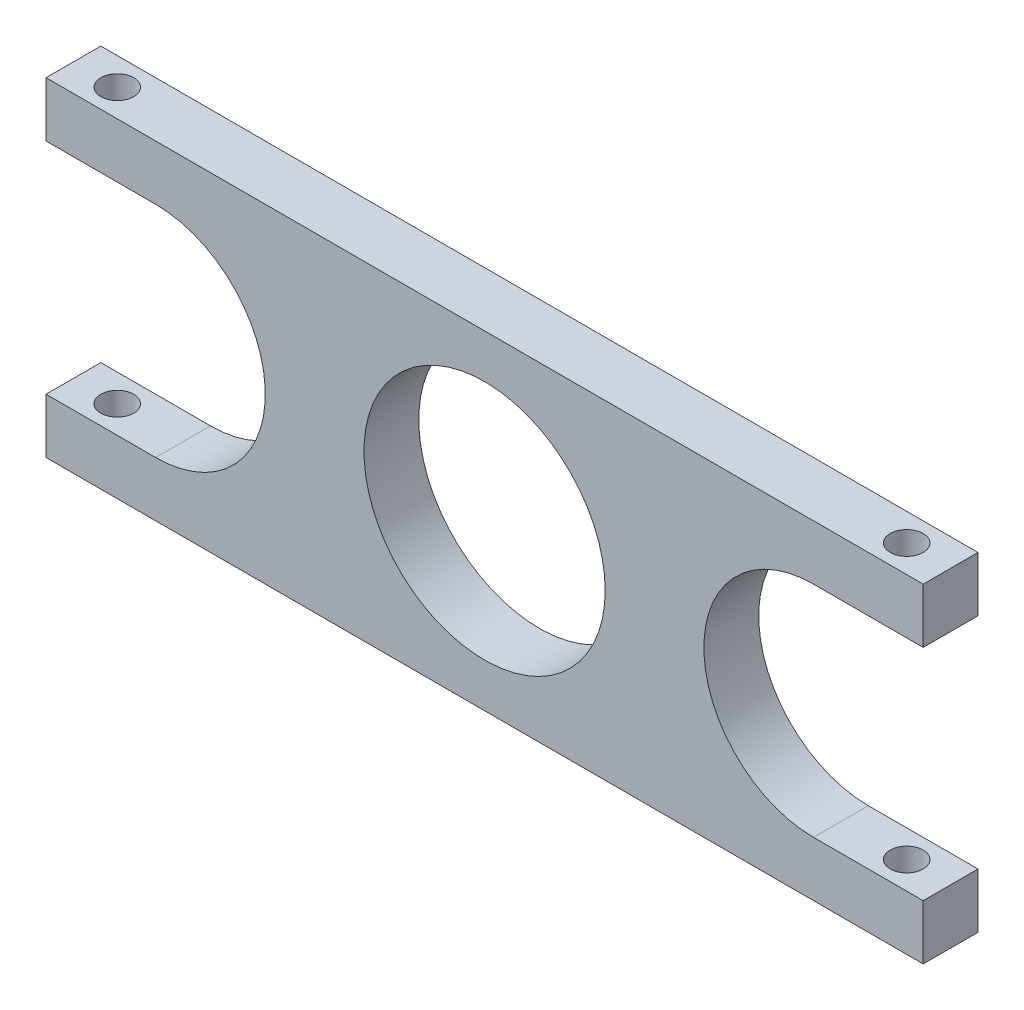
ISO-10303-21;
HEADER;
FILE_DESCRIPTION(('STEP AP214'),'2;1');
FILE_NAME('part.step','',(''),(''),'','','');
FILE_SCHEMA(('AUTOMOTIVE_DESIGN { 1 0 10303 214 1 1 1 1 }'));
ENDSEC;
DATA;
#1=APPLICATION_CONTEXT('core data for automotive mechanical design processes');
#2=APPLICATION_PROTOCOL_DEFINITION('international standard','automotive_design',2000,#1);
#3=PRODUCT_CONTEXT('',#1,'mechanical');
#4=PRODUCT('Part','Part','',(#3));
#5=PRODUCT_RELATED_PRODUCT_CATEGORY('part','',(#4));
#6=PRODUCT_DEFINITION_FORMATION('','',#4);
#7=PRODUCT_DEFINITION_CONTEXT('part definition',#1,'design');
#8=PRODUCT_DEFINITION('design','',#6,#7);
#9=PRODUCT_DEFINITION_SHAPE('','',#8);
#10=(LENGTH_UNIT() NAMED_UNIT(*) SI_UNIT(.MILLI.,.METRE.));
#11=(NAMED_UNIT(*) PLANE_ANGLE_UNIT() SI_UNIT($,.RADIAN.));
#12=(NAMED_UNIT(*) SI_UNIT($,.STERADIAN.) SOLID_ANGLE_UNIT());
#13=UNCERTAINTY_MEASURE_WITH_UNIT(LENGTH_MEASURE(1.E-05),#10,'distance_accuracy_value','');
#14=(GEOMETRIC_REPRESENTATION_CONTEXT(3) GLOBAL_UNCERTAINTY_ASSIGNED_CONTEXT((#13)) GLOBAL_UNIT_ASSIGNED_CONTEXT((#10,
#11,#12)) REPRESENTATION_CONTEXT('',''));
#15=CARTESIAN_POINT('',(0.,0.,0.));
#16=DIRECTION('',(0.,0.,1.));
#17=DIRECTION('',(1.,0.,0.));
#18=AXIS2_PLACEMENT_3D('',#15,#16,#17);
#19=CARTESIAN_POINT('',(70.,15.,5.));
#20=DIRECTION('',(0.,0.,1.));
#21=DIRECTION('',(1.,0.,0.));
#22=AXIS2_PLACEMENT_3D('',#19,#20,#21);
#23=PLANE('',#22);
#24=DIRECTION('',(0.,-1.,0.));
#25=VECTOR('',#24,1.);
#26=CARTESIAN_POINT('',(0.,5.,5.));
#27=LINE('',#26,#25);
#28=CARTESIAN_POINT('',(0.,5.,5.));
#29=VERTEX_POINT('',#28);
#30=CARTESIAN_POINT('',(0.,0.,5.));
#31=VERTEX_POINT('',#30);
#32=EDGE_CURVE('E190',#29,#31,#27,.T.);
#33=ORIENTED_EDGE('',*,*,#32,.T.);
#34=DIRECTION('',(1.,0.,0.));
#35=VECTOR('',#34,1.);
#36=CARTESIAN_POINT('',(0.,0.,5.));
#37=LINE('',#36,#35);
#38=CARTESIAN_POINT('',(80.,0.,5.));
#39=VERTEX_POINT('',#38);
#40=EDGE_CURVE('E118',#31,#39,#37,.T.);
#41=ORIENTED_EDGE('',*,*,#40,.T.);
#42=DIRECTION('',(0.,1.,0.));
#43=VECTOR('',#42,1.);
#44=CARTESIAN_POINT('',(80.,0.,5.));
#45=LINE('',#44,#43);
#46=CARTESIAN_POINT('',(80.,5.,5.));
#47=VERTEX_POINT('',#46);
#48=EDGE_CURVE('E218',#39,#47,#45,.T.);
#49=ORIENTED_EDGE('',*,*,#48,.T.);
#50=DIRECTION('',(-1.,0.,0.));
#51=VECTOR('',#50,1.);
#52=CARTESIAN_POINT('',(80.,5.,5.));
#53=LINE('',#52,#51);
#54=CARTESIAN_POINT('',(70.,5.,5.));
#55=VERTEX_POINT('',#54);
#56=EDGE_CURVE('E237',#47,#55,#53,.T.);
#57=ORIENTED_EDGE('',*,*,#56,.T.);
#58=CARTESIAN_POINT('',(70.,15.,5.));
#59=DIRECTION('',(0.,0.,-1.));
#60=DIRECTION('',(1.,0.,0.));
#61=AXIS2_PLACEMENT_3D('',#58,#59,#60);
#62=CIRCLE('',#61,10.);
#63=CARTESIAN_POINT('',(70.,25.,5.));
#64=VERTEX_POINT('',#63);
#65=EDGE_CURVE('E234',#55,#64,#62,.T.);
#66=ORIENTED_EDGE('',*,*,#65,.T.);
#67=DIRECTION('',(1.,0.,0.));
#68=VECTOR('',#67,1.);
#69=CARTESIAN_POINT('',(70.,25.,5.));
#70=LINE('',#69,#68);
#71=CARTESIAN_POINT('',(80.,25.,5.));
#72=VERTEX_POINT('',#71);
#73=EDGE_CURVE('E236',#64,#72,#70,.T.);
#74=ORIENTED_EDGE('',*,*,#73,.T.);
#75=DIRECTION('',(0.,1.,0.));
#76=VECTOR('',#75,1.);
#77=CARTESIAN_POINT('',(80.,25.,5.));
#78=LINE('',#77,#76);
#79=CARTESIAN_POINT('',(80.,30.,5.));
#80=VERTEX_POINT('',#79);
#81=EDGE_CURVE('E239',#72,#80,#78,.T.);
#82=ORIENTED_EDGE('',*,*,#81,.T.);
#83=DIRECTION('',(-1.,0.,0.));
#84=VECTOR('',#83,1.);
#85=CARTESIAN_POINT('',(80.,30.,5.));
#86=LINE('',#85,#84);
#87=CARTESIAN_POINT('',(0.,30.,5.));
#88=VERTEX_POINT('',#87);
#89=EDGE_CURVE('E245',#80,#88,#86,.T.);
#90=ORIENTED_EDGE('',*,*,#89,.T.);
#91=DIRECTION('',(0.,-1.,0.));
#92=VECTOR('',#91,1.);
#93=CARTESIAN_POINT('',(0.,30.,5.));
#94=LINE('',#93,#92);
#95=CARTESIAN_POINT('',(0.,25.,5.));
#96=VERTEX_POINT('',#95);
#97=EDGE_CURVE('E149',#88,#96,#94,.T.);
#98=ORIENTED_EDGE('',*,*,#97,.T.);
#99=DIRECTION('',(1.,0.,0.));
#100=VECTOR('',#99,1.);
#101=CARTESIAN_POINT('',(0.,25.,5.));
#102=LINE('',#101,#100);
#103=CARTESIAN_POINT('',(10.,25.,5.));
#104=VERTEX_POINT('',#103);
#105=EDGE_CURVE('E143',#96,#104,#102,.T.);
#106=ORIENTED_EDGE('',*,*,#105,.T.);
#107=CARTESIAN_POINT('',(10.,15.,5.));
#108=DIRECTION('',(0.,0.,-1.));
#109=DIRECTION('',(-1.,0.,0.));
#110=AXIS2_PLACEMENT_3D('',#107,#108,#109);
#111=CIRCLE('',#110,9.99999999999999);
#112=CARTESIAN_POINT('',(10.,5.,5.));
#113=VERTEX_POINT('',#112);
#114=EDGE_CURVE('E147',#104,#113,#111,.T.);
#115=ORIENTED_EDGE('',*,*,#114,.T.);
#116=DIRECTION('',(-1.,0.,0.));
#117=VECTOR('',#116,1.);
#118=CARTESIAN_POINT('',(10.,5.,5.));
#119=LINE('',#118,#117);
#120=EDGE_CURVE('E63',#113,#29,#119,.T.);
#121=ORIENTED_EDGE('',*,*,#120,.T.);
#122=EDGE_LOOP('',(#33,#41,#49,#57,#66,#74,#82,#90,#98,#106,#115,#121));
#123=FACE_BOUND('',#122,.T.);
#124=CARTESIAN_POINT('',(40.,15.,5.));
#125=DIRECTION('',(0.,0.,1.));
#126=DIRECTION('',(1.,0.,0.));
#127=AXIS2_PLACEMENT_3D('',#124,#125,#126);
#128=CIRCLE('',#127,11.);
#129=CARTESIAN_POINT('',(51.,15.,5.));
#130=VERTEX_POINT('',#129);
#131=EDGE_CURVE('E171',#130,#130,#128,.T.);
#132=ORIENTED_EDGE('',*,*,#131,.F.);
#133=EDGE_LOOP('',(#132));
#134=FACE_BOUND('',#133,.T.);
#135=ADVANCED_FACE('F45',(#123,#134),#23,.T.);
#136=CARTESIAN_POINT('',(70.,15.,0.));
#137=DIRECTION('',(0.,0.,1.));
#138=DIRECTION('',(1.,0.,0.));
#139=AXIS2_PLACEMENT_3D('',#136,#137,#138);
#140=PLANE('',#139);
#141=DIRECTION('',(0.,-1.,0.));
#142=VECTOR('',#141,1.);
#143=CARTESIAN_POINT('',(0.,5.,0.));
#144=LINE('',#143,#142);
#145=CARTESIAN_POINT('',(0.,5.,0.));
#146=VERTEX_POINT('',#145);
#147=CARTESIAN_POINT('',(0.,0.,0.));
#148=VERTEX_POINT('',#147);
#149=EDGE_CURVE('E167',#146,#148,#144,.T.);
#150=ORIENTED_EDGE('',*,*,#149,.F.);
#151=DIRECTION('',(-1.,0.,0.));
#152=VECTOR('',#151,1.);
#153=CARTESIAN_POINT('',(10.,5.,0.));
#154=LINE('',#153,#152);
#155=CARTESIAN_POINT('',(10.,5.,0.));
#156=VERTEX_POINT('',#155);
#157=EDGE_CURVE('E110',#156,#146,#154,.T.);
#158=ORIENTED_EDGE('',*,*,#157,.F.);
#159=CARTESIAN_POINT('',(10.,15.,0.));
#160=DIRECTION('',(0.,0.,-1.));
#161=DIRECTION('',(-1.,0.,0.));
#162=AXIS2_PLACEMENT_3D('',#159,#160,#161);
#163=CIRCLE('',#162,9.99999999999999);
#164=CARTESIAN_POINT('',(10.,25.,0.));
#165=VERTEX_POINT('',#164);
#166=EDGE_CURVE('E104',#165,#156,#163,.T.);
#167=ORIENTED_EDGE('',*,*,#166,.F.);
#168=DIRECTION('',(1.,0.,0.));
#169=VECTOR('',#168,1.);
#170=CARTESIAN_POINT('',(0.,25.,0.));
#171=LINE('',#170,#169);
#172=CARTESIAN_POINT('',(0.,25.,0.));
#173=VERTEX_POINT('',#172);
#174=EDGE_CURVE('E157',#173,#165,#171,.T.);
#175=ORIENTED_EDGE('',*,*,#174,.F.);
#176=DIRECTION('',(0.,-1.,0.));
#177=VECTOR('',#176,1.);
#178=CARTESIAN_POINT('',(0.,30.,0.));
#179=LINE('',#178,#177);
#180=CARTESIAN_POINT('',(0.,30.,0.));
#181=VERTEX_POINT('',#180);
#182=EDGE_CURVE('E185',#181,#173,#179,.T.);
#183=ORIENTED_EDGE('',*,*,#182,.F.);
#184=DIRECTION('',(-1.,0.,0.));
#185=VECTOR('',#184,1.);
#186=CARTESIAN_POINT('',(80.,30.,0.));
#187=LINE('',#186,#185);
#188=CARTESIAN_POINT('',(80.,30.,0.));
#189=VERTEX_POINT('',#188);
#190=EDGE_CURVE('E183',#189,#181,#187,.T.);
#191=ORIENTED_EDGE('',*,*,#190,.F.);
#192=DIRECTION('',(0.,1.,0.));
#193=VECTOR('',#192,1.);
#194=CARTESIAN_POINT('',(80.,25.,0.));
#195=LINE('',#194,#193);
#196=CARTESIAN_POINT('',(80.,25.,0.));
#197=VERTEX_POINT('',#196);
#198=EDGE_CURVE('E181',#197,#189,#195,.T.);
#199=ORIENTED_EDGE('',*,*,#198,.F.);
#200=DIRECTION('',(1.,0.,0.));
#201=VECTOR('',#200,1.);
#202=CARTESIAN_POINT('',(70.,25.,0.));
#203=LINE('',#202,#201);
#204=CARTESIAN_POINT('',(70.,25.,0.));
#205=VERTEX_POINT('',#204);
#206=EDGE_CURVE('E179',#205,#197,#203,.T.);
#207=ORIENTED_EDGE('',*,*,#206,.F.);
#208=CARTESIAN_POINT('',(70.,15.,0.));
#209=DIRECTION('',(0.,0.,-1.));
#210=DIRECTION('',(1.,0.,0.));
#211=AXIS2_PLACEMENT_3D('',#208,#209,#210);
#212=CIRCLE('',#211,10.);
#213=CARTESIAN_POINT('',(70.,5.,0.));
#214=VERTEX_POINT('',#213);
#215=EDGE_CURVE('E177',#214,#205,#212,.T.);
#216=ORIENTED_EDGE('',*,*,#215,.F.);
#217=DIRECTION('',(-1.,0.,0.));
#218=VECTOR('',#217,1.);
#219=CARTESIAN_POINT('',(80.,5.,0.));
#220=LINE('',#219,#218);
#221=CARTESIAN_POINT('',(80.,5.,0.));
#222=VERTEX_POINT('',#221);
#223=EDGE_CURVE('E175',#222,#214,#220,.T.);
#224=ORIENTED_EDGE('',*,*,#223,.F.);
#225=DIRECTION('',(0.,1.,0.));
#226=VECTOR('',#225,1.);
#227=CARTESIAN_POINT('',(80.,0.,0.));
#228=LINE('',#227,#226);
#229=CARTESIAN_POINT('',(80.,0.,0.));
#230=VERTEX_POINT('',#229);
#231=EDGE_CURVE('E173',#230,#222,#228,.T.);
#232=ORIENTED_EDGE('',*,*,#231,.F.);
#233=DIRECTION('',(1.,0.,0.));
#234=VECTOR('',#233,1.);
#235=CARTESIAN_POINT('',(0.,0.,0.));
#236=LINE('',#235,#234);
#237=EDGE_CURVE('E170',#148,#230,#236,.T.);
#238=ORIENTED_EDGE('',*,*,#237,.F.);
#239=EDGE_LOOP('',(#150,#158,#167,#175,#183,#191,#199,#207,#216,#224,#232,#238));
#240=FACE_BOUND('',#239,.T.);
#241=CARTESIAN_POINT('',(40.,15.,0.));
#242=DIRECTION('',(0.,0.,1.));
#243=DIRECTION('',(1.,0.,0.));
#244=AXIS2_PLACEMENT_3D('',#241,#242,#243);
#245=CIRCLE('',#244,11.);
#246=CARTESIAN_POINT('',(51.,15.,0.));
#247=VERTEX_POINT('',#246);
#248=EDGE_CURVE('E315',#247,#247,#245,.T.);
#249=ORIENTED_EDGE('',*,*,#248,.T.);
#250=EDGE_LOOP('',(#249));
#251=FACE_BOUND('',#250,.T.);
#252=ADVANCED_FACE('F222',(#240,#251),#140,.F.);
#253=CARTESIAN_POINT('',(0.,5.,5.));
#254=DIRECTION('',(1.,0.,0.));
#255=DIRECTION('',(0.,1.,0.));
#256=AXIS2_PLACEMENT_3D('',#253,#254,#255);
#257=PLANE('',#256);
#258=ORIENTED_EDGE('',*,*,#149,.T.);
#259=DIRECTION('',(0.,0.,-1.));
#260=VECTOR('',#259,1.);
#261=CARTESIAN_POINT('',(0.,0.,5.));
#262=LINE('',#261,#260);
#263=EDGE_CURVE('E13',#31,#148,#262,.T.);
#264=ORIENTED_EDGE('',*,*,#263,.F.);
#265=ORIENTED_EDGE('',*,*,#32,.F.);
#266=DIRECTION('',(0.,0.,-1.));
#267=VECTOR('',#266,1.);
#268=CARTESIAN_POINT('',(0.,5.,5.));
#269=LINE('',#268,#267);
#270=EDGE_CURVE('E163',#29,#146,#269,.T.);
#271=ORIENTED_EDGE('',*,*,#270,.T.);
#272=EDGE_LOOP('',(#258,#264,#265,#271));
#273=FACE_BOUND('',#272,.T.);
#274=ADVANCED_FACE('F47',(#273),#257,.F.);
#275=CARTESIAN_POINT('',(0.,0.,5.));
#276=DIRECTION('',(0.,1.,0.));
#277=DIRECTION('',(0.,0.,1.));
#278=AXIS2_PLACEMENT_3D('',#275,#276,#277);
#279=PLANE('',#278);
#280=CARTESIAN_POINT('',(4.,0.,2.5));
#281=DIRECTION('',(0.,1.,0.));
#282=DIRECTION('',(0.,0.,1.));
#283=AXIS2_PLACEMENT_3D('',#280,#281,#282);
#284=CIRCLE('',#283,1.49999999999999);
#285=CARTESIAN_POINT('',(4.,0.,3.99999999999999));
#286=VERTEX_POINT('',#285);
#287=EDGE_CURVE('E306',#286,#286,#284,.T.);
#288=ORIENTED_EDGE('',*,*,#287,.T.);
#289=EDGE_LOOP('',(#288));
#290=FACE_BOUND('',#289,.T.);
#291=CARTESIAN_POINT('',(76.,0.,2.5));
#292=DIRECTION('',(0.,1.,0.));
#293=DIRECTION('',(0.,0.,1.));
#294=AXIS2_PLACEMENT_3D('',#291,#292,#293);
#295=CIRCLE('',#294,1.49999999999999);
#296=CARTESIAN_POINT('',(76.,0.,3.99999999999999));
#297=VERTEX_POINT('',#296);
#298=EDGE_CURVE('E304',#297,#297,#295,.T.);
#299=ORIENTED_EDGE('',*,*,#298,.T.);
#300=EDGE_LOOP('',(#299));
#301=FACE_BOUND('',#300,.T.);
#302=ORIENTED_EDGE('',*,*,#237,.T.);
#303=DIRECTION('',(0.,0.,-1.));
#304=VECTOR('',#303,1.);
#305=CARTESIAN_POINT('',(80.,0.,5.));
#306=LINE('',#305,#304);
#307=EDGE_CURVE('E55',#39,#230,#306,.T.);
#308=ORIENTED_EDGE('',*,*,#307,.F.);
#309=ORIENTED_EDGE('',*,*,#40,.F.);
#310=ORIENTED_EDGE('',*,*,#263,.T.);
#311=EDGE_LOOP('',(#302,#308,#309,#310));
#312=FACE_BOUND('',#311,.T.);
#313=ADVANCED_FACE('F336',(#290,#301,#312),#279,.F.);
#314=CARTESIAN_POINT('',(80.,0.,5.));
#315=DIRECTION('',(-1.,0.,0.));
#316=DIRECTION('',(0.,0.,1.));
#317=AXIS2_PLACEMENT_3D('',#314,#315,#316);
#318=PLANE('',#317);
#319=ORIENTED_EDGE('',*,*,#231,.T.);
#320=DIRECTION('',(0.,0.,-1.));
#321=VECTOR('',#320,1.);
#322=CARTESIAN_POINT('',(80.,5.,5.));
#323=LINE('',#322,#321);
#324=EDGE_CURVE('E209',#47,#222,#323,.T.);
#325=ORIENTED_EDGE('',*,*,#324,.F.);
#326=ORIENTED_EDGE('',*,*,#48,.F.);
#327=ORIENTED_EDGE('',*,*,#307,.T.);
#328=EDGE_LOOP('',(#319,#325,#326,#327));
#329=FACE_BOUND('',#328,.T.);
#330=ADVANCED_FACE('F216',(#329),#318,.F.);
#331=CARTESIAN_POINT('',(80.,5.,5.));
#332=DIRECTION('',(0.,-1.,0.));
#333=DIRECTION('',(0.,0.,-1.));
#334=AXIS2_PLACEMENT_3D('',#331,#332,#333);
#335=PLANE('',#334);
#336=CARTESIAN_POINT('',(76.,5.,2.5));
#337=DIRECTION('',(0.,-1.,0.));
#338=DIRECTION('',(0.,0.,-1.));
#339=AXIS2_PLACEMENT_3D('',#336,#337,#338);
#340=CIRCLE('',#339,1.49999999999999);
#341=CARTESIAN_POINT('',(76.,5.,1.00000000000001));
#342=VERTEX_POINT('',#341);
#343=EDGE_CURVE('E49',#342,#342,#340,.T.);
#344=ORIENTED_EDGE('',*,*,#343,.T.);
#345=EDGE_LOOP('',(#344));
#346=FACE_BOUND('',#345,.T.);
#347=ORIENTED_EDGE('',*,*,#223,.T.);
#348=DIRECTION('',(0.,0.,-1.));
#349=VECTOR('',#348,1.);
#350=CARTESIAN_POINT('',(70.,5.,5.));
#351=LINE('',#350,#349);
#352=EDGE_CURVE('E206',#55,#214,#351,.T.);
#353=ORIENTED_EDGE('',*,*,#352,.F.);
#354=ORIENTED_EDGE('',*,*,#56,.F.);
#355=ORIENTED_EDGE('',*,*,#324,.T.);
#356=EDGE_LOOP('',(#347,#353,#354,#355));
#357=FACE_BOUND('',#356,.T.);
#358=ADVANCED_FACE('F228',(#346,#357),#335,.F.);
#359=CARTESIAN_POINT('',(70.,15.,5.));
#360=DIRECTION('',(0.,0.,-1.));
#361=DIRECTION('',(-1.,0.,0.));
#362=AXIS2_PLACEMENT_3D('',#359,#360,#361);
#363=CYLINDRICAL_SURFACE('',#362,10.);
#364=ORIENTED_EDGE('',*,*,#215,.T.);
#365=DIRECTION('',(0.,0.,-1.));
#366=VECTOR('',#365,1.);
#367=CARTESIAN_POINT('',(70.,25.,5.));
#368=LINE('',#367,#366);
#369=EDGE_CURVE('E203',#64,#205,#368,.T.);
#370=ORIENTED_EDGE('',*,*,#369,.F.);
#371=ORIENTED_EDGE('',*,*,#65,.F.);
#372=ORIENTED_EDGE('',*,*,#352,.T.);
#373=EDGE_LOOP('',(#364,#370,#371,#372));
#374=FACE_BOUND('',#373,.T.);
#375=ADVANCED_FACE('F232',(#374),#363,.F.);
#376=CARTESIAN_POINT('',(70.,25.,5.));
#377=DIRECTION('',(0.,1.,0.));
#378=DIRECTION('',(0.,0.,1.));
#379=AXIS2_PLACEMENT_3D('',#376,#377,#378);
#380=PLANE('',#379);
#381=CARTESIAN_POINT('',(76.,25.,2.5));
#382=DIRECTION('',(0.,1.,0.));
#383=DIRECTION('',(0.,0.,1.));
#384=AXIS2_PLACEMENT_3D('',#381,#382,#383);
#385=CIRCLE('',#384,1.49999999999999);
#386=CARTESIAN_POINT('',(76.,25.,3.99999999999999));
#387=VERTEX_POINT('',#386);
#388=EDGE_CURVE('E312',#387,#387,#385,.T.);
#389=ORIENTED_EDGE('',*,*,#388,.T.);
#390=EDGE_LOOP('',(#389));
#391=FACE_BOUND('',#390,.T.);
#392=ORIENTED_EDGE('',*,*,#206,.T.);
#393=DIRECTION('',(0.,0.,-1.));
#394=VECTOR('',#393,1.);
#395=CARTESIAN_POINT('',(80.,25.,5.));
#396=LINE('',#395,#394);
#397=EDGE_CURVE('E200',#72,#197,#396,.T.);
#398=ORIENTED_EDGE('',*,*,#397,.F.);
#399=ORIENTED_EDGE('',*,*,#73,.F.);
#400=ORIENTED_EDGE('',*,*,#369,.T.);
#401=EDGE_LOOP('',(#392,#398,#399,#400));
#402=FACE_BOUND('',#401,.T.);
#403=ADVANCED_FACE('F350',(#391,#402),#380,.F.);
#404=CARTESIAN_POINT('',(80.,25.,5.));
#405=DIRECTION('',(-1.,0.,0.));
#406=DIRECTION('',(0.,0.,1.));
#407=AXIS2_PLACEMENT_3D('',#404,#405,#406);
#408=PLANE('',#407);
#409=ORIENTED_EDGE('',*,*,#198,.T.);
#410=DIRECTION('',(0.,0.,-1.));
#411=VECTOR('',#410,1.);
#412=CARTESIAN_POINT('',(80.,30.,5.));
#413=LINE('',#412,#411);
#414=EDGE_CURVE('E197',#80,#189,#413,.T.);
#415=ORIENTED_EDGE('',*,*,#414,.F.);
#416=ORIENTED_EDGE('',*,*,#81,.F.);
#417=ORIENTED_EDGE('',*,*,#397,.T.);
#418=EDGE_LOOP('',(#409,#415,#416,#417));
#419=FACE_BOUND('',#418,.T.);
#420=ADVANCED_FACE('F353',(#419),#408,.F.);
#421=CARTESIAN_POINT('',(80.,30.,5.));
#422=DIRECTION('',(0.,-1.,0.));
#423=DIRECTION('',(1.,0.,0.));
#424=AXIS2_PLACEMENT_3D('',#421,#422,#423);
#425=PLANE('',#424);
#426=CARTESIAN_POINT('',(4.,30.,2.5));
#427=DIRECTION('',(0.,1.,0.));
#428=DIRECTION('',(0.,0.,1.));
#429=AXIS2_PLACEMENT_3D('',#426,#427,#428);
#430=CIRCLE('',#429,1.5);
#431=CARTESIAN_POINT('',(4.,30.,4.));
#432=VERTEX_POINT('',#431);
#433=EDGE_CURVE('E295',#432,#432,#430,.T.);
#434=ORIENTED_EDGE('',*,*,#433,.F.);
#435=EDGE_LOOP('',(#434));
#436=FACE_BOUND('',#435,.T.);
#437=CARTESIAN_POINT('',(76.,30.,2.5));
#438=DIRECTION('',(0.,1.,0.));
#439=DIRECTION('',(0.,0.,1.));
#440=AXIS2_PLACEMENT_3D('',#437,#438,#439);
#441=CIRCLE('',#440,1.5);
#442=CARTESIAN_POINT('',(76.,30.,4.));
#443=VERTEX_POINT('',#442);
#444=EDGE_CURVE('E300',#443,#443,#441,.T.);
#445=ORIENTED_EDGE('',*,*,#444,.F.);
#446=EDGE_LOOP('',(#445));
#447=FACE_BOUND('',#446,.T.);
#448=ORIENTED_EDGE('',*,*,#190,.T.);
#449=DIRECTION('',(0.,0.,-1.));
#450=VECTOR('',#449,1.);
#451=CARTESIAN_POINT('',(0.,30.,5.));
#452=LINE('',#451,#450);
#453=EDGE_CURVE('E194',#88,#181,#452,.T.);
#454=ORIENTED_EDGE('',*,*,#453,.F.);
#455=ORIENTED_EDGE('',*,*,#89,.F.);
#456=ORIENTED_EDGE('',*,*,#414,.T.);
#457=EDGE_LOOP('',(#448,#454,#455,#456));
#458=FACE_BOUND('',#457,.T.);
#459=ADVANCED_FACE('F251',(#436,#447,#458),#425,.F.);
#460=CARTESIAN_POINT('',(0.,30.,5.));
#461=DIRECTION('',(1.,0.,0.));
#462=DIRECTION('',(0.,1.,0.));
#463=AXIS2_PLACEMENT_3D('',#460,#461,#462);
#464=PLANE('',#463);
#465=ORIENTED_EDGE('',*,*,#182,.T.);
#466=DIRECTION('',(0.,0.,-1.));
#467=VECTOR('',#466,1.);
#468=CARTESIAN_POINT('',(0.,25.,5.));
#469=LINE('',#468,#467);
#470=EDGE_CURVE('E158',#96,#173,#469,.T.);
#471=ORIENTED_EDGE('',*,*,#470,.F.);
#472=ORIENTED_EDGE('',*,*,#97,.F.);
#473=ORIENTED_EDGE('',*,*,#453,.T.);
#474=EDGE_LOOP('',(#465,#471,#472,#473));
#475=FACE_BOUND('',#474,.T.);
#476=ADVANCED_FACE('F255',(#475),#464,.F.);
#477=CARTESIAN_POINT('',(0.,25.,5.));
#478=DIRECTION('',(0.,1.,0.));
#479=DIRECTION('',(0.,0.,1.));
#480=AXIS2_PLACEMENT_3D('',#477,#478,#479);
#481=PLANE('',#480);
#482=CARTESIAN_POINT('',(4.,25.,2.5));
#483=DIRECTION('',(0.,1.,0.));
#484=DIRECTION('',(0.,0.,1.));
#485=AXIS2_PLACEMENT_3D('',#482,#483,#484);
#486=CIRCLE('',#485,1.49999999999999);
#487=CARTESIAN_POINT('',(4.,25.,3.99999999999999));
#488=VERTEX_POINT('',#487);
#489=EDGE_CURVE('E298',#488,#488,#486,.T.);
#490=ORIENTED_EDGE('',*,*,#489,.T.);
#491=EDGE_LOOP('',(#490));
#492=FACE_BOUND('',#491,.T.);
#493=ORIENTED_EDGE('',*,*,#174,.T.);
#494=DIRECTION('',(0.,0.,-1.));
#495=VECTOR('',#494,1.);
#496=CARTESIAN_POINT('',(10.,25.,5.));
#497=LINE('',#496,#495);
#498=EDGE_CURVE('E154',#104,#165,#497,.T.);
#499=ORIENTED_EDGE('',*,*,#498,.F.);
#500=ORIENTED_EDGE('',*,*,#105,.F.);
#501=ORIENTED_EDGE('',*,*,#470,.T.);
#502=EDGE_LOOP('',(#493,#499,#500,#501));
#503=FACE_BOUND('',#502,.T.);
#504=ADVANCED_FACE('F155',(#492,#503),#481,.F.);
#505=CARTESIAN_POINT('',(10.,15.,5.));
#506=DIRECTION('',(0.,0.,-1.));
#507=DIRECTION('',(-1.,0.,0.));
#508=AXIS2_PLACEMENT_3D('',#505,#506,#507);
#509=CYLINDRICAL_SURFACE('',#508,9.99999999999999);
#510=ORIENTED_EDGE('',*,*,#166,.T.);
#511=DIRECTION('',(0.,0.,-1.));
#512=VECTOR('',#511,1.);
#513=CARTESIAN_POINT('',(10.,5.,5.));
#514=LINE('',#513,#512);
#515=EDGE_CURVE('E159',#113,#156,#514,.T.);
#516=ORIENTED_EDGE('',*,*,#515,.F.);
#517=ORIENTED_EDGE('',*,*,#114,.F.);
#518=ORIENTED_EDGE('',*,*,#498,.T.);
#519=EDGE_LOOP('',(#510,#516,#517,#518));
#520=FACE_BOUND('',#519,.T.);
#521=ADVANCED_FACE('F161',(#520),#509,.F.);
#522=CARTESIAN_POINT('',(10.,5.,5.));
#523=DIRECTION('',(0.,-1.,0.));
#524=DIRECTION('',(1.,0.,0.));
#525=AXIS2_PLACEMENT_3D('',#522,#523,#524);
#526=PLANE('',#525);
#527=CARTESIAN_POINT('',(4.,5.,2.5));
#528=DIRECTION('',(0.,-1.,0.));
#529=DIRECTION('',(1.,0.,0.));
#530=AXIS2_PLACEMENT_3D('',#527,#528,#529);
#531=CIRCLE('',#530,1.49999999999999);
#532=CARTESIAN_POINT('',(5.49999999999999,5.,2.5));
#533=VERTEX_POINT('',#532);
#534=EDGE_CURVE('E301',#533,#533,#531,.T.);
#535=ORIENTED_EDGE('',*,*,#534,.T.);
#536=EDGE_LOOP('',(#535));
#537=FACE_BOUND('',#536,.T.);
#538=ORIENTED_EDGE('',*,*,#157,.T.);
#539=ORIENTED_EDGE('',*,*,#270,.F.);
#540=ORIENTED_EDGE('',*,*,#120,.F.);
#541=ORIENTED_EDGE('',*,*,#515,.T.);
#542=EDGE_LOOP('',(#538,#539,#540,#541));
#543=FACE_BOUND('',#542,.T.);
#544=ADVANCED_FACE('F259',(#537,#543),#526,.F.);
#545=CARTESIAN_POINT('',(40.,15.,5.));
#546=DIRECTION('',(0.,0.,-1.));
#547=DIRECTION('',(-1.,0.,0.));
#548=AXIS2_PLACEMENT_3D('',#545,#546,#547);
#549=CYLINDRICAL_SURFACE('',#548,11.);
#550=ORIENTED_EDGE('',*,*,#131,.T.);
#551=EDGE_LOOP('',(#550));
#552=FACE_BOUND('',#551,.T.);
#553=ORIENTED_EDGE('',*,*,#248,.F.);
#554=EDGE_LOOP('',(#553));
#555=FACE_BOUND('',#554,.T.);
#556=ADVANCED_FACE('F261',(#552,#555),#549,.F.);
#557=CARTESIAN_POINT('',(76.,30.,2.5));
#558=DIRECTION('',(0.,1.,0.));
#559=DIRECTION('',(0.,0.,1.));
#560=AXIS2_PLACEMENT_3D('',#557,#558,#559);
#561=CYLINDRICAL_SURFACE('',#560,1.49999999999999);
#562=ORIENTED_EDGE('',*,*,#298,.F.);
#563=EDGE_LOOP('',(#562));
#564=FACE_BOUND('',#563,.T.);
#565=ORIENTED_EDGE('',*,*,#343,.F.);
#566=EDGE_LOOP('',(#565));
#567=FACE_BOUND('',#566,.T.);
#568=ADVANCED_FACE('F268',(#564,#567),#561,.F.);
#569=ORIENTED_EDGE('',*,*,#444,.T.);
#570=EDGE_LOOP('',(#569));
#571=FACE_BOUND('',#570,.T.);
#572=ORIENTED_EDGE('',*,*,#388,.F.);
#573=EDGE_LOOP('',(#572));
#574=FACE_BOUND('',#573,.T.);
#575=ADVANCED_FACE('F280',(#571,#574),#561,.F.);
#576=CARTESIAN_POINT('',(4.,30.,2.5));
#577=DIRECTION('',(0.,1.,0.));
#578=DIRECTION('',(0.,0.,1.));
#579=AXIS2_PLACEMENT_3D('',#576,#577,#578);
#580=CYLINDRICAL_SURFACE('',#579,1.49999999999999);
#581=ORIENTED_EDGE('',*,*,#287,.F.);
#582=EDGE_LOOP('',(#581));
#583=FACE_BOUND('',#582,.T.);
#584=ORIENTED_EDGE('',*,*,#534,.F.);
#585=EDGE_LOOP('',(#584));
#586=FACE_BOUND('',#585,.T.);
#587=ADVANCED_FACE('F283',(#583,#586),#580,.F.);
#588=ORIENTED_EDGE('',*,*,#433,.T.);
#589=EDGE_LOOP('',(#588));
#590=FACE_BOUND('',#589,.T.);
#591=ORIENTED_EDGE('',*,*,#489,.F.);
#592=EDGE_LOOP('',(#591));
#593=FACE_BOUND('',#592,.T.);
#594=ADVANCED_FACE('F285',(#590,#593),#580,.F.);
#595=CLOSED_SHELL('',(#135,#252,#274,#313,#330,#358,#375,#403,#420,#459,#476,#504,#521,#544,
#556,#568,#575,#587,#594));
#596=MANIFOLD_SOLID_BREP('B2',#595);
#597=ADVANCED_BREP_SHAPE_REPRESENTATION('',(#18,#596),#14);
#598=SHAPE_DEFINITION_REPRESENTATION(#9,#597);
ENDSEC;
END-ISO-10303-21;
